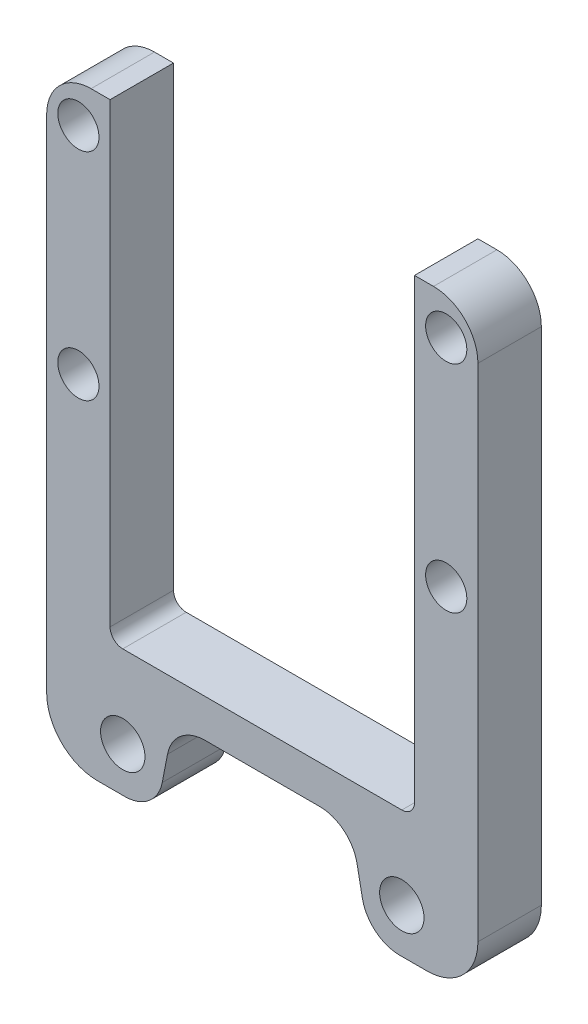
ISO-10303-21;
HEADER;
FILE_DESCRIPTION(('STEP AP214'),'2;1');
FILE_NAME('part.step','',(''),(''),'','','');
FILE_SCHEMA(('AUTOMOTIVE_DESIGN { 1 0 10303 214 1 1 1 1 }'));
ENDSEC;
DATA;
#1=APPLICATION_CONTEXT('core data for automotive mechanical design processes');
#2=APPLICATION_PROTOCOL_DEFINITION('international standard','automotive_design',2000,#1);
#3=PRODUCT_CONTEXT('',#1,'mechanical');
#4=PRODUCT('Part','Part','',(#3));
#5=PRODUCT_RELATED_PRODUCT_CATEGORY('part','',(#4));
#6=PRODUCT_DEFINITION_FORMATION('','',#4);
#7=PRODUCT_DEFINITION_CONTEXT('part definition',#1,'design');
#8=PRODUCT_DEFINITION('design','',#6,#7);
#9=PRODUCT_DEFINITION_SHAPE('','',#8);
#10=(LENGTH_UNIT() NAMED_UNIT(*) SI_UNIT(.MILLI.,.METRE.));
#11=(NAMED_UNIT(*) PLANE_ANGLE_UNIT() SI_UNIT($,.RADIAN.));
#12=(NAMED_UNIT(*) SI_UNIT($,.STERADIAN.) SOLID_ANGLE_UNIT());
#13=UNCERTAINTY_MEASURE_WITH_UNIT(LENGTH_MEASURE(1.E-05),#10,'distance_accuracy_value','');
#14=(GEOMETRIC_REPRESENTATION_CONTEXT(3) GLOBAL_UNCERTAINTY_ASSIGNED_CONTEXT((#13)) GLOBAL_UNIT_ASSIGNED_CONTEXT((#10,
#11,#12)) REPRESENTATION_CONTEXT('',''));
#15=CARTESIAN_POINT('',(0.,0.,0.));
#16=DIRECTION('',(0.,0.,1.));
#17=DIRECTION('',(1.,0.,0.));
#18=AXIS2_PLACEMENT_3D('',#15,#16,#17);
#19=CARTESIAN_POINT('',(0.,0.,10.));
#20=DIRECTION('',(0.,0.,1.));
#21=DIRECTION('',(1.,0.,0.));
#22=AXIS2_PLACEMENT_3D('',#19,#20,#21);
#23=PLANE('',#22);
#24=CARTESIAN_POINT('',(29.,104.,10.));
#25=DIRECTION('',(0.,0.,1.));
#26=DIRECTION('',(1.,0.,0.));
#27=AXIS2_PLACEMENT_3D('',#24,#25,#26);
#28=CIRCLE('',#27,3.25);
#29=CARTESIAN_POINT('',(32.25,104.,10.));
#30=VERTEX_POINT('',#29);
#31=EDGE_CURVE('E260',#30,#30,#28,.T.);
#32=ORIENTED_EDGE('',*,*,#31,.F.);
#33=EDGE_LOOP('',(#32));
#34=FACE_BOUND('',#33,.T.);
#35=DIRECTION('',(0.,1.,0.));
#36=VECTOR('',#35,1.);
#37=CARTESIAN_POINT('',(34.,16.,10.));
#38=LINE('',#37,#36);
#39=CARTESIAN_POINT('',(34.,24.,10.));
#40=VERTEX_POINT('',#39);
#41=CARTESIAN_POINT('',(34.,103.,10.));
#42=VERTEX_POINT('',#41);
#43=EDGE_CURVE('E298',#40,#42,#38,.T.);
#44=ORIENTED_EDGE('',*,*,#43,.T.);
#45=CARTESIAN_POINT('',(27.,103.,10.));
#46=DIRECTION('',(0.,0.,1.));
#47=DIRECTION('',(1.,0.,0.));
#48=AXIS2_PLACEMENT_3D('',#45,#46,#47);
#49=CIRCLE('',#48,7.);
#50=CARTESIAN_POINT('',(27.,110.,10.));
#51=VERTEX_POINT('',#50);
#52=EDGE_CURVE('E423',#42,#51,#49,.T.);
#53=ORIENTED_EDGE('',*,*,#52,.T.);
#54=DIRECTION('',(-1.,0.,0.));
#55=VECTOR('',#54,1.);
#56=CARTESIAN_POINT('',(34.,110.,10.));
#57=LINE('',#56,#55);
#58=CARTESIAN_POINT('',(24.,110.,10.));
#59=VERTEX_POINT('',#58);
#60=EDGE_CURVE('E276',#51,#59,#57,.T.);
#61=ORIENTED_EDGE('',*,*,#60,.T.);
#62=DIRECTION('',(0.,-1.,0.));
#63=VECTOR('',#62,1.);
#64=CARTESIAN_POINT('',(24.,110.,10.));
#65=LINE('',#64,#63);
#66=CARTESIAN_POINT('',(24.,38.,10.));
#67=VERTEX_POINT('',#66);
#68=EDGE_CURVE('E279',#59,#67,#65,.T.);
#69=ORIENTED_EDGE('',*,*,#68,.T.);
#70=CARTESIAN_POINT('',(22.,38.,10.));
#71=DIRECTION('',(0.,0.,1.));
#72=DIRECTION('',(1.,0.,0.));
#73=AXIS2_PLACEMENT_3D('',#70,#71,#72);
#74=CIRCLE('',#73,2.);
#75=CARTESIAN_POINT('',(22.,36.,10.));
#76=VERTEX_POINT('',#75);
#77=EDGE_CURVE('E11',#67,#76,#74,.F.);
#78=ORIENTED_EDGE('',*,*,#77,.T.);
#79=DIRECTION('',(-1.,0.,0.));
#80=VECTOR('',#79,1.);
#81=CARTESIAN_POINT('',(24.,36.,10.));
#82=LINE('',#81,#80);
#83=CARTESIAN_POINT('',(-22.,36.,10.));
#84=VERTEX_POINT('',#83);
#85=EDGE_CURVE('E283',#76,#84,#82,.T.);
#86=ORIENTED_EDGE('',*,*,#85,.T.);
#87=CARTESIAN_POINT('',(-22.,38.,10.));
#88=DIRECTION('',(0.,0.,1.));
#89=DIRECTION('',(1.,0.,0.));
#90=AXIS2_PLACEMENT_3D('',#87,#88,#89);
#91=CIRCLE('',#90,2.);
#92=CARTESIAN_POINT('',(-24.,38.,10.));
#93=VERTEX_POINT('',#92);
#94=EDGE_CURVE('E219',#84,#93,#91,.F.);
#95=ORIENTED_EDGE('',*,*,#94,.T.);
#96=DIRECTION('',(0.,-1.,0.));
#97=VECTOR('',#96,1.);
#98=CARTESIAN_POINT('',(-24.,110.,10.));
#99=LINE('',#98,#97);
#100=CARTESIAN_POINT('',(-24.,110.,10.));
#101=VERTEX_POINT('',#100);
#102=EDGE_CURVE('E201',#101,#93,#99,.T.);
#103=ORIENTED_EDGE('',*,*,#102,.F.);
#104=DIRECTION('',(1.,0.,0.));
#105=VECTOR('',#104,1.);
#106=CARTESIAN_POINT('',(-34.,110.,10.));
#107=LINE('',#106,#105);
#108=CARTESIAN_POINT('',(-27.,110.,10.));
#109=VERTEX_POINT('',#108);
#110=EDGE_CURVE('E189',#109,#101,#107,.T.);
#111=ORIENTED_EDGE('',*,*,#110,.F.);
#112=CARTESIAN_POINT('',(-27.,103.,10.));
#113=DIRECTION('',(0.,0.,1.));
#114=DIRECTION('',(1.,0.,0.));
#115=AXIS2_PLACEMENT_3D('',#112,#113,#114);
#116=CIRCLE('',#115,7.);
#117=CARTESIAN_POINT('',(-34.,103.,10.));
#118=VERTEX_POINT('',#117);
#119=EDGE_CURVE('E420',#109,#118,#116,.T.);
#120=ORIENTED_EDGE('',*,*,#119,.T.);
#121=DIRECTION('',(0.,1.,0.));
#122=VECTOR('',#121,1.);
#123=CARTESIAN_POINT('',(-34.,16.,10.));
#124=LINE('',#123,#122);
#125=CARTESIAN_POINT('',(-34.,24.,10.));
#126=VERTEX_POINT('',#125);
#127=EDGE_CURVE('E213',#126,#118,#124,.T.);
#128=ORIENTED_EDGE('',*,*,#127,.F.);
#129=CARTESIAN_POINT('',(-26.,24.,10.));
#130=DIRECTION('',(0.,0.,1.));
#131=DIRECTION('',(1.,0.,0.));
#132=AXIS2_PLACEMENT_3D('',#129,#130,#131);
#133=CIRCLE('',#132,8.);
#134=CARTESIAN_POINT('',(-26.,16.,10.));
#135=VERTEX_POINT('',#134);
#136=EDGE_CURVE('E397',#126,#135,#133,.T.);
#137=ORIENTED_EDGE('',*,*,#136,.T.);
#138=DIRECTION('',(-1.,0.,0.));
#139=VECTOR('',#138,1.);
#140=CARTESIAN_POINT('',(-16.721324327928,16.,10.));
#141=LINE('',#140,#139);
#142=CARTESIAN_POINT('',(-21.667342642833,16.,10.));
#143=VERTEX_POINT('',#142);
#144=EDGE_CURVE('E225',#143,#135,#141,.T.);
#145=ORIENTED_EDGE('',*,*,#144,.F.);
#146=CARTESIAN_POINT('',(-21.667342642833,22.,10.));
#147=DIRECTION('',(0.,0.,1.));
#148=DIRECTION('',(1.,0.,0.));
#149=AXIS2_PLACEMENT_3D('',#146,#147,#148);
#150=CIRCLE('',#149,6.);
#151=CARTESIAN_POINT('',(-15.777579542147,20.8551460277407,10.));
#152=VERTEX_POINT('',#151);
#153=EDGE_CURVE('E346',#143,#152,#150,.T.);
#154=ORIENTED_EDGE('',*,*,#153,.T.);
#155=DIRECTION('',(-0.190808995376542,-0.981627183447665,0.));
#156=VECTOR('',#155,1.);
#157=CARTESIAN_POINT('',(-14.,30.,10.));
#158=LINE('',#157,#156);
#159=CARTESIAN_POINT('',(-14.943744785781,25.1448539722593,10.));
#160=VERTEX_POINT('',#159);
#161=EDGE_CURVE('E221',#160,#152,#158,.T.);
#162=ORIENTED_EDGE('',*,*,#161,.F.);
#163=CARTESIAN_POINT('',(-9.05398168509501,24.,10.));
#164=DIRECTION('',(0.,0.,1.));
#165=DIRECTION('',(1.,0.,0.));
#166=AXIS2_PLACEMENT_3D('',#163,#164,#165);
#167=CIRCLE('',#166,6.);
#168=CARTESIAN_POINT('',(-9.05398168509501,30.,10.));
#169=VERTEX_POINT('',#168);
#170=EDGE_CURVE('E372',#160,#169,#167,.F.);
#171=ORIENTED_EDGE('',*,*,#170,.T.);
#172=DIRECTION('',(1.,0.,0.));
#173=VECTOR('',#172,1.);
#174=CARTESIAN_POINT('',(0.,30.,10.));
#175=LINE('',#174,#173);
#176=CARTESIAN_POINT('',(9.05398168509501,30.,10.));
#177=VERTEX_POINT('',#176);
#178=EDGE_CURVE('E286',#169,#177,#175,.T.);
#179=ORIENTED_EDGE('',*,*,#178,.T.);
#180=CARTESIAN_POINT('',(9.05398168509501,24.,10.));
#181=DIRECTION('',(0.,0.,1.));
#182=DIRECTION('',(1.,0.,0.));
#183=AXIS2_PLACEMENT_3D('',#180,#181,#182);
#184=CIRCLE('',#183,6.);
#185=CARTESIAN_POINT('',(14.943744785781,25.1448539722593,10.));
#186=VERTEX_POINT('',#185);
#187=EDGE_CURVE('E378',#177,#186,#184,.F.);
#188=ORIENTED_EDGE('',*,*,#187,.T.);
#189=DIRECTION('',(0.190808995376542,-0.981627183447665,0.));
#190=VECTOR('',#189,1.);
#191=CARTESIAN_POINT('',(14.,30.,10.));
#192=LINE('',#191,#190);
#193=CARTESIAN_POINT('',(15.777579542147,20.8551460277407,10.));
#194=VERTEX_POINT('',#193);
#195=EDGE_CURVE('E290',#186,#194,#192,.T.);
#196=ORIENTED_EDGE('',*,*,#195,.T.);
#197=CARTESIAN_POINT('',(21.667342642833,22.,10.));
#198=DIRECTION('',(0.,0.,1.));
#199=DIRECTION('',(1.,0.,0.));
#200=AXIS2_PLACEMENT_3D('',#197,#198,#199);
#201=CIRCLE('',#200,6.);
#202=CARTESIAN_POINT('',(21.667342642833,16.,10.));
#203=VERTEX_POINT('',#202);
#204=EDGE_CURVE('E349',#194,#203,#201,.T.);
#205=ORIENTED_EDGE('',*,*,#204,.T.);
#206=DIRECTION('',(1.,0.,0.));
#207=VECTOR('',#206,1.);
#208=CARTESIAN_POINT('',(16.721324327928,16.,10.));
#209=LINE('',#208,#207);
#210=CARTESIAN_POINT('',(26.,16.,10.));
#211=VERTEX_POINT('',#210);
#212=EDGE_CURVE('E294',#203,#211,#209,.T.);
#213=ORIENTED_EDGE('',*,*,#212,.T.);
#214=CARTESIAN_POINT('',(26.,24.,10.));
#215=DIRECTION('',(0.,0.,1.));
#216=DIRECTION('',(1.,0.,0.));
#217=AXIS2_PLACEMENT_3D('',#214,#215,#216);
#218=CIRCLE('',#217,8.);
#219=EDGE_CURVE('E394',#211,#40,#218,.T.);
#220=ORIENTED_EDGE('',*,*,#219,.T.);
#221=EDGE_LOOP('',(#44,#53,#61,#69,#78,#86,#95,#103,#111,#120,#128,#137,#145,#154,#162,#171,
#179,#188,#196,#205,#213,#220));
#222=FACE_BOUND('',#221,.T.);
#223=CARTESIAN_POINT('',(22.,23.,10.));
#224=DIRECTION('',(0.,0.,1.));
#225=DIRECTION('',(1.,0.,0.));
#226=AXIS2_PLACEMENT_3D('',#223,#224,#225);
#227=CIRCLE('',#226,3.5);
#228=CARTESIAN_POINT('',(25.5,23.,10.));
#229=VERTEX_POINT('',#228);
#230=EDGE_CURVE('E268',#229,#229,#227,.T.);
#231=ORIENTED_EDGE('',*,*,#230,.F.);
#232=EDGE_LOOP('',(#231));
#233=FACE_BOUND('',#232,.T.);
#234=CARTESIAN_POINT('',(29.,70.,10.));
#235=DIRECTION('',(0.,0.,1.));
#236=DIRECTION('',(1.,0.,0.));
#237=AXIS2_PLACEMENT_3D('',#234,#235,#236);
#238=CIRCLE('',#237,3.25);
#239=CARTESIAN_POINT('',(32.25,70.,10.));
#240=VERTEX_POINT('',#239);
#241=EDGE_CURVE('E252',#240,#240,#238,.T.);
#242=ORIENTED_EDGE('',*,*,#241,.F.);
#243=EDGE_LOOP('',(#242));
#244=FACE_BOUND('',#243,.T.);
#245=CARTESIAN_POINT('',(-29.,104.,10.));
#246=DIRECTION('',(0.,0.,-1.));
#247=DIRECTION('',(-1.,0.,0.));
#248=AXIS2_PLACEMENT_3D('',#245,#246,#247);
#249=CIRCLE('',#248,3.25);
#250=CARTESIAN_POINT('',(-32.25,104.,10.));
#251=VERTEX_POINT('',#250);
#252=EDGE_CURVE('E634',#251,#251,#249,.T.);
#253=ORIENTED_EDGE('',*,*,#252,.T.);
#254=EDGE_LOOP('',(#253));
#255=FACE_BOUND('',#254,.T.);
#256=CARTESIAN_POINT('',(-22.,23.,10.));
#257=DIRECTION('',(0.,0.,-1.));
#258=DIRECTION('',(-1.,0.,0.));
#259=AXIS2_PLACEMENT_3D('',#256,#257,#258);
#260=CIRCLE('',#259,3.5);
#261=CARTESIAN_POINT('',(-25.5,23.,10.));
#262=VERTEX_POINT('',#261);
#263=EDGE_CURVE('E238',#262,#262,#260,.T.);
#264=ORIENTED_EDGE('',*,*,#263,.T.);
#265=EDGE_LOOP('',(#264));
#266=FACE_BOUND('',#265,.T.);
#267=CARTESIAN_POINT('',(-29.,70.,10.));
#268=DIRECTION('',(0.,0.,-1.));
#269=DIRECTION('',(-1.,0.,0.));
#270=AXIS2_PLACEMENT_3D('',#267,#268,#269);
#271=CIRCLE('',#270,3.25);
#272=CARTESIAN_POINT('',(-32.25,70.,10.));
#273=VERTEX_POINT('',#272);
#274=EDGE_CURVE('E628',#273,#273,#271,.T.);
#275=ORIENTED_EDGE('',*,*,#274,.T.);
#276=EDGE_LOOP('',(#275));
#277=FACE_BOUND('',#276,.T.);
#278=ADVANCED_FACE('F39',(#34,#222,#233,#244,#255,#266,#277),#23,.T.);
#279=CARTESIAN_POINT('',(0.,0.,0.));
#280=DIRECTION('',(0.,0.,1.));
#281=DIRECTION('',(1.,0.,0.));
#282=AXIS2_PLACEMENT_3D('',#279,#280,#281);
#283=PLANE('',#282);
#284=DIRECTION('',(-1.,0.,0.));
#285=VECTOR('',#284,1.);
#286=CARTESIAN_POINT('',(34.,110.,0.));
#287=LINE('',#286,#285);
#288=CARTESIAN_POINT('',(27.,110.,0.));
#289=VERTEX_POINT('',#288);
#290=CARTESIAN_POINT('',(24.,110.,0.));
#291=VERTEX_POINT('',#290);
#292=EDGE_CURVE('E272',#289,#291,#287,.T.);
#293=ORIENTED_EDGE('',*,*,#292,.F.);
#294=CARTESIAN_POINT('',(27.,103.,0.));
#295=DIRECTION('',(0.,0.,1.));
#296=DIRECTION('',(1.,0.,0.));
#297=AXIS2_PLACEMENT_3D('',#294,#295,#296);
#298=CIRCLE('',#297,7.);
#299=CARTESIAN_POINT('',(34.,103.,0.));
#300=VERTEX_POINT('',#299);
#301=EDGE_CURVE('E414',#289,#300,#298,.F.);
#302=ORIENTED_EDGE('',*,*,#301,.T.);
#303=DIRECTION('',(0.,1.,0.));
#304=VECTOR('',#303,1.);
#305=CARTESIAN_POINT('',(34.,16.,0.));
#306=LINE('',#305,#304);
#307=CARTESIAN_POINT('',(34.,24.,0.));
#308=VERTEX_POINT('',#307);
#309=EDGE_CURVE('E280',#308,#300,#306,.T.);
#310=ORIENTED_EDGE('',*,*,#309,.F.);
#311=CARTESIAN_POINT('',(26.,24.,0.));
#312=DIRECTION('',(0.,0.,1.));
#313=DIRECTION('',(1.,0.,0.));
#314=AXIS2_PLACEMENT_3D('',#311,#312,#313);
#315=CIRCLE('',#314,8.);
#316=CARTESIAN_POINT('',(26.,16.,0.));
#317=VERTEX_POINT('',#316);
#318=EDGE_CURVE('E385',#308,#317,#315,.F.);
#319=ORIENTED_EDGE('',*,*,#318,.T.);
#320=DIRECTION('',(1.,0.,0.));
#321=VECTOR('',#320,1.);
#322=CARTESIAN_POINT('',(16.721324327928,16.,0.));
#323=LINE('',#322,#321);
#324=CARTESIAN_POINT('',(21.667342642833,16.,0.));
#325=VERTEX_POINT('',#324);
#326=EDGE_CURVE('E319',#325,#317,#323,.T.);
#327=ORIENTED_EDGE('',*,*,#326,.F.);
#328=CARTESIAN_POINT('',(21.667342642833,22.,0.));
#329=DIRECTION('',(0.,0.,1.));
#330=DIRECTION('',(1.,0.,0.));
#331=AXIS2_PLACEMENT_3D('',#328,#329,#330);
#332=CIRCLE('',#331,6.);
#333=CARTESIAN_POINT('',(15.777579542147,20.8551460277407,0.));
#334=VERTEX_POINT('',#333);
#335=EDGE_CURVE('E336',#325,#334,#332,.F.);
#336=ORIENTED_EDGE('',*,*,#335,.T.);
#337=DIRECTION('',(0.190808995376542,-0.981627183447665,0.));
#338=VECTOR('',#337,1.);
#339=CARTESIAN_POINT('',(14.,30.,0.));
#340=LINE('',#339,#338);
#341=CARTESIAN_POINT('',(14.943744785781,25.1448539722593,0.));
#342=VERTEX_POINT('',#341);
#343=EDGE_CURVE('E315',#342,#334,#340,.T.);
#344=ORIENTED_EDGE('',*,*,#343,.F.);
#345=CARTESIAN_POINT('',(9.05398168509501,24.,0.));
#346=DIRECTION('',(0.,0.,1.));
#347=DIRECTION('',(1.,0.,0.));
#348=AXIS2_PLACEMENT_3D('',#345,#346,#347);
#349=CIRCLE('',#348,6.);
#350=CARTESIAN_POINT('',(9.05398168509501,30.,0.));
#351=VERTEX_POINT('',#350);
#352=EDGE_CURVE('E375',#342,#351,#349,.T.);
#353=ORIENTED_EDGE('',*,*,#352,.T.);
#354=DIRECTION('',(1.,0.,0.));
#355=VECTOR('',#354,1.);
#356=CARTESIAN_POINT('',(0.,30.,0.));
#357=LINE('',#356,#355);
#358=CARTESIAN_POINT('',(-9.05398168509501,30.,0.));
#359=VERTEX_POINT('',#358);
#360=EDGE_CURVE('E311',#359,#351,#357,.T.);
#361=ORIENTED_EDGE('',*,*,#360,.F.);
#362=CARTESIAN_POINT('',(-9.05398168509501,24.,0.));
#363=DIRECTION('',(0.,0.,1.));
#364=DIRECTION('',(1.,0.,0.));
#365=AXIS2_PLACEMENT_3D('',#362,#363,#364);
#366=CIRCLE('',#365,6.);
#367=CARTESIAN_POINT('',(-14.943744785781,25.1448539722593,0.));
#368=VERTEX_POINT('',#367);
#369=EDGE_CURVE('E369',#359,#368,#366,.T.);
#370=ORIENTED_EDGE('',*,*,#369,.T.);
#371=DIRECTION('',(-0.190808995376542,-0.981627183447665,0.));
#372=VECTOR('',#371,1.);
#373=CARTESIAN_POINT('',(-14.,30.,0.));
#374=LINE('',#373,#372);
#375=CARTESIAN_POINT('',(-15.777579542147,20.8551460277407,0.));
#376=VERTEX_POINT('',#375);
#377=EDGE_CURVE('E241',#368,#376,#374,.T.);
#378=ORIENTED_EDGE('',*,*,#377,.T.);
#379=CARTESIAN_POINT('',(-21.667342642833,22.,0.));
#380=DIRECTION('',(0.,0.,1.));
#381=DIRECTION('',(1.,0.,0.));
#382=AXIS2_PLACEMENT_3D('',#379,#380,#381);
#383=CIRCLE('',#382,6.);
#384=CARTESIAN_POINT('',(-21.667342642833,16.,0.));
#385=VERTEX_POINT('',#384);
#386=EDGE_CURVE('E333',#376,#385,#383,.F.);
#387=ORIENTED_EDGE('',*,*,#386,.T.);
#388=DIRECTION('',(-1.,0.,0.));
#389=VECTOR('',#388,1.);
#390=CARTESIAN_POINT('',(-16.721324327928,16.,0.));
#391=LINE('',#390,#389);
#392=CARTESIAN_POINT('',(-26.,16.,0.));
#393=VERTEX_POINT('',#392);
#394=EDGE_CURVE('E245',#385,#393,#391,.T.);
#395=ORIENTED_EDGE('',*,*,#394,.T.);
#396=CARTESIAN_POINT('',(-26.,24.,0.));
#397=DIRECTION('',(0.,0.,1.));
#398=DIRECTION('',(1.,0.,0.));
#399=AXIS2_PLACEMENT_3D('',#396,#397,#398);
#400=CIRCLE('',#399,8.);
#401=CARTESIAN_POINT('',(-34.,24.,0.));
#402=VERTEX_POINT('',#401);
#403=EDGE_CURVE('E388',#393,#402,#400,.F.);
#404=ORIENTED_EDGE('',*,*,#403,.T.);
#405=DIRECTION('',(0.,1.,0.));
#406=VECTOR('',#405,1.);
#407=CARTESIAN_POINT('',(-34.,16.,0.));
#408=LINE('',#407,#406);
#409=CARTESIAN_POINT('',(-34.,103.,0.));
#410=VERTEX_POINT('',#409);
#411=EDGE_CURVE('E202',#402,#410,#408,.T.);
#412=ORIENTED_EDGE('',*,*,#411,.T.);
#413=CARTESIAN_POINT('',(-27.,103.,0.));
#414=DIRECTION('',(0.,0.,1.));
#415=DIRECTION('',(1.,0.,0.));
#416=AXIS2_PLACEMENT_3D('',#413,#414,#415);
#417=CIRCLE('',#416,7.);
#418=CARTESIAN_POINT('',(-27.,110.,0.));
#419=VERTEX_POINT('',#418);
#420=EDGE_CURVE('E411',#410,#419,#417,.F.);
#421=ORIENTED_EDGE('',*,*,#420,.T.);
#422=DIRECTION('',(1.,0.,0.));
#423=VECTOR('',#422,1.);
#424=CARTESIAN_POINT('',(-34.,110.,0.));
#425=LINE('',#424,#423);
#426=CARTESIAN_POINT('',(-24.,110.,0.));
#427=VERTEX_POINT('',#426);
#428=EDGE_CURVE('E235',#419,#427,#425,.T.);
#429=ORIENTED_EDGE('',*,*,#428,.T.);
#430=DIRECTION('',(0.,-1.,0.));
#431=VECTOR('',#430,1.);
#432=CARTESIAN_POINT('',(-24.,110.,0.));
#433=LINE('',#432,#431);
#434=CARTESIAN_POINT('',(-24.,38.,0.));
#435=VERTEX_POINT('',#434);
#436=EDGE_CURVE('E210',#427,#435,#433,.T.);
#437=ORIENTED_EDGE('',*,*,#436,.T.);
#438=CARTESIAN_POINT('',(-22.,38.,0.));
#439=DIRECTION('',(0.,0.,1.));
#440=DIRECTION('',(1.,0.,0.));
#441=AXIS2_PLACEMENT_3D('',#438,#439,#440);
#442=CIRCLE('',#441,2.);
#443=CARTESIAN_POINT('',(-22.,36.,0.));
#444=VERTEX_POINT('',#443);
#445=EDGE_CURVE('E444',#435,#444,#442,.T.);
#446=ORIENTED_EDGE('',*,*,#445,.T.);
#447=DIRECTION('',(-1.,0.,0.));
#448=VECTOR('',#447,1.);
#449=CARTESIAN_POINT('',(24.,36.,0.));
#450=LINE('',#449,#448);
#451=CARTESIAN_POINT('',(22.,36.,0.));
#452=VERTEX_POINT('',#451);
#453=EDGE_CURVE('E307',#452,#444,#450,.T.);
#454=ORIENTED_EDGE('',*,*,#453,.F.);
#455=CARTESIAN_POINT('',(22.,38.,0.));
#456=DIRECTION('',(0.,0.,1.));
#457=DIRECTION('',(1.,0.,0.));
#458=AXIS2_PLACEMENT_3D('',#455,#456,#457);
#459=CIRCLE('',#458,2.);
#460=CARTESIAN_POINT('',(24.,38.,0.));
#461=VERTEX_POINT('',#460);
#462=EDGE_CURVE('E48',#452,#461,#459,.T.);
#463=ORIENTED_EDGE('',*,*,#462,.T.);
#464=DIRECTION('',(0.,-1.,0.));
#465=VECTOR('',#464,1.);
#466=CARTESIAN_POINT('',(24.,110.,0.));
#467=LINE('',#466,#465);
#468=EDGE_CURVE('E304',#291,#461,#467,.T.);
#469=ORIENTED_EDGE('',*,*,#468,.F.);
#470=EDGE_LOOP('',(#293,#302,#310,#319,#327,#336,#344,#353,#361,#370,#378,#387,#395,#404,#412,
#421,#429,#437,#446,#454,#463,#469));
#471=FACE_BOUND('',#470,.T.);
#472=CARTESIAN_POINT('',(22.,23.,0.));
#473=DIRECTION('',(0.,0.,1.));
#474=DIRECTION('',(1.,0.,0.));
#475=AXIS2_PLACEMENT_3D('',#472,#473,#474);
#476=CIRCLE('',#475,3.5);
#477=CARTESIAN_POINT('',(25.5,23.,0.));
#478=VERTEX_POINT('',#477);
#479=EDGE_CURVE('E264',#478,#478,#476,.T.);
#480=ORIENTED_EDGE('',*,*,#479,.T.);
#481=EDGE_LOOP('',(#480));
#482=FACE_BOUND('',#481,.T.);
#483=CARTESIAN_POINT('',(29.,104.,0.));
#484=DIRECTION('',(0.,0.,1.));
#485=DIRECTION('',(1.,0.,0.));
#486=AXIS2_PLACEMENT_3D('',#483,#484,#485);
#487=CIRCLE('',#486,3.25);
#488=CARTESIAN_POINT('',(32.25,104.,0.));
#489=VERTEX_POINT('',#488);
#490=EDGE_CURVE('E256',#489,#489,#487,.T.);
#491=ORIENTED_EDGE('',*,*,#490,.T.);
#492=EDGE_LOOP('',(#491));
#493=FACE_BOUND('',#492,.T.);
#494=CARTESIAN_POINT('',(29.,70.,0.));
#495=DIRECTION('',(0.,0.,1.));
#496=DIRECTION('',(1.,0.,0.));
#497=AXIS2_PLACEMENT_3D('',#494,#495,#496);
#498=CIRCLE('',#497,3.25);
#499=CARTESIAN_POINT('',(32.25,70.,0.));
#500=VERTEX_POINT('',#499);
#501=EDGE_CURVE('E212',#500,#500,#498,.T.);
#502=ORIENTED_EDGE('',*,*,#501,.T.);
#503=EDGE_LOOP('',(#502));
#504=FACE_BOUND('',#503,.T.);
#505=CARTESIAN_POINT('',(-22.,23.,0.));
#506=DIRECTION('',(0.,0.,-1.));
#507=DIRECTION('',(-1.,0.,0.));
#508=AXIS2_PLACEMENT_3D('',#505,#506,#507);
#509=CIRCLE('',#508,3.5);
#510=CARTESIAN_POINT('',(-25.5,23.,0.));
#511=VERTEX_POINT('',#510);
#512=EDGE_CURVE('E618',#511,#511,#509,.T.);
#513=ORIENTED_EDGE('',*,*,#512,.F.);
#514=EDGE_LOOP('',(#513));
#515=FACE_BOUND('',#514,.T.);
#516=CARTESIAN_POINT('',(-29.,104.,0.));
#517=DIRECTION('',(0.,0.,-1.));
#518=DIRECTION('',(-1.,0.,0.));
#519=AXIS2_PLACEMENT_3D('',#516,#517,#518);
#520=CIRCLE('',#519,3.25);
#521=CARTESIAN_POINT('',(-32.25,104.,0.));
#522=VERTEX_POINT('',#521);
#523=EDGE_CURVE('E622',#522,#522,#520,.T.);
#524=ORIENTED_EDGE('',*,*,#523,.F.);
#525=EDGE_LOOP('',(#524));
#526=FACE_BOUND('',#525,.T.);
#527=CARTESIAN_POINT('',(-29.,70.,0.));
#528=DIRECTION('',(0.,0.,-1.));
#529=DIRECTION('',(-1.,0.,0.));
#530=AXIS2_PLACEMENT_3D('',#527,#528,#529);
#531=CIRCLE('',#530,3.25);
#532=CARTESIAN_POINT('',(-32.25,70.,0.));
#533=VERTEX_POINT('',#532);
#534=EDGE_CURVE('E625',#533,#533,#531,.T.);
#535=ORIENTED_EDGE('',*,*,#534,.F.);
#536=EDGE_LOOP('',(#535));
#537=FACE_BOUND('',#536,.T.);
#538=ADVANCED_FACE('F450',(#471,#482,#493,#504,#515,#526,#537),#283,.F.);
#539=CARTESIAN_POINT('',(34.,110.,10.));
#540=DIRECTION('',(0.,-1.,0.));
#541=DIRECTION('',(0.,0.,-1.));
#542=AXIS2_PLACEMENT_3D('',#539,#540,#541);
#543=PLANE('',#542);
#544=ORIENTED_EDGE('',*,*,#60,.F.);
#545=DIRECTION('',(0.,0.,-1.));
#546=VECTOR('',#545,1.);
#547=CARTESIAN_POINT('',(27.,110.,10.));
#548=LINE('',#547,#546);
#549=EDGE_CURVE('E407',#51,#289,#548,.T.);
#550=ORIENTED_EDGE('',*,*,#549,.T.);
#551=ORIENTED_EDGE('',*,*,#292,.T.);
#552=DIRECTION('',(0.,0.,-1.));
#553=VECTOR('',#552,1.);
#554=CARTESIAN_POINT('',(24.,110.,10.));
#555=LINE('',#554,#553);
#556=EDGE_CURVE('E301',#59,#291,#555,.T.);
#557=ORIENTED_EDGE('',*,*,#556,.F.);
#558=EDGE_LOOP('',(#544,#550,#551,#557));
#559=FACE_BOUND('',#558,.T.);
#560=ADVANCED_FACE('F475',(#559),#543,.F.);
#561=CARTESIAN_POINT('',(24.,110.,10.));
#562=DIRECTION('',(1.,0.,0.));
#563=DIRECTION('',(0.,1.,0.));
#564=AXIS2_PLACEMENT_3D('',#561,#562,#563);
#565=PLANE('',#564);
#566=ORIENTED_EDGE('',*,*,#468,.T.);
#567=DIRECTION('',(0.,0.,-1.));
#568=VECTOR('',#567,1.);
#569=CARTESIAN_POINT('',(24.,38.,10.));
#570=LINE('',#569,#568);
#571=EDGE_CURVE('E55',#461,#67,#570,.F.);
#572=ORIENTED_EDGE('',*,*,#571,.T.);
#573=ORIENTED_EDGE('',*,*,#68,.F.);
#574=ORIENTED_EDGE('',*,*,#556,.T.);
#575=EDGE_LOOP('',(#566,#572,#573,#574));
#576=FACE_BOUND('',#575,.T.);
#577=ADVANCED_FACE('F500',(#576),#565,.F.);
#578=CARTESIAN_POINT('',(24.,36.,10.));
#579=DIRECTION('',(0.,-1.,0.));
#580=DIRECTION('',(0.,0.,-1.));
#581=AXIS2_PLACEMENT_3D('',#578,#579,#580);
#582=PLANE('',#581);
#583=ORIENTED_EDGE('',*,*,#453,.T.);
#584=DIRECTION('',(0.,0.,-1.));
#585=VECTOR('',#584,1.);
#586=CARTESIAN_POINT('',(-22.,36.,10.));
#587=LINE('',#586,#585);
#588=EDGE_CURVE('E439',#444,#84,#587,.F.);
#589=ORIENTED_EDGE('',*,*,#588,.T.);
#590=ORIENTED_EDGE('',*,*,#85,.F.);
#591=DIRECTION('',(0.,0.,-1.));
#592=VECTOR('',#591,1.);
#593=CARTESIAN_POINT('',(22.,36.,0.));
#594=LINE('',#593,#592);
#595=EDGE_CURVE('E435',#76,#452,#594,.T.);
#596=ORIENTED_EDGE('',*,*,#595,.T.);
#597=EDGE_LOOP('',(#583,#589,#590,#596));
#598=FACE_BOUND('',#597,.T.);
#599=ADVANCED_FACE('F455',(#598),#582,.F.);
#600=CARTESIAN_POINT('',(0.,30.,10.));
#601=DIRECTION('',(0.,1.,0.));
#602=DIRECTION('',(0.,0.,1.));
#603=AXIS2_PLACEMENT_3D('',#600,#601,#602);
#604=PLANE('',#603);
#605=ORIENTED_EDGE('',*,*,#178,.F.);
#606=DIRECTION('',(0.,0.,-1.));
#607=VECTOR('',#606,1.);
#608=CARTESIAN_POINT('',(-9.05398168509501,30.,0.));
#609=LINE('',#608,#607);
#610=EDGE_CURVE('E365',#169,#359,#609,.T.);
#611=ORIENTED_EDGE('',*,*,#610,.T.);
#612=ORIENTED_EDGE('',*,*,#360,.T.);
#613=DIRECTION('',(0.,0.,-1.));
#614=VECTOR('',#613,1.);
#615=CARTESIAN_POINT('',(9.05398168509501,30.,10.));
#616=LINE('',#615,#614);
#617=EDGE_CURVE('E362',#351,#177,#616,.F.);
#618=ORIENTED_EDGE('',*,*,#617,.T.);
#619=EDGE_LOOP('',(#605,#611,#612,#618));
#620=FACE_BOUND('',#619,.T.);
#621=ADVANCED_FACE('F493',(#620),#604,.F.);
#622=CARTESIAN_POINT('',(14.,30.,10.));
#623=DIRECTION('',(0.981627183447665,0.190808995376542,0.));
#624=DIRECTION('',(-0.190808995376542,0.981627183447665,0.));
#625=AXIS2_PLACEMENT_3D('',#622,#623,#624);
#626=PLANE('',#625);
#627=ORIENTED_EDGE('',*,*,#343,.T.);
#628=DIRECTION('',(0.,0.,-1.));
#629=VECTOR('',#628,1.);
#630=CARTESIAN_POINT('',(15.777579542147,20.8551460277407,10.));
#631=LINE('',#630,#629);
#632=EDGE_CURVE('E343',#334,#194,#631,.F.);
#633=ORIENTED_EDGE('',*,*,#632,.T.);
#634=ORIENTED_EDGE('',*,*,#195,.F.);
#635=DIRECTION('',(0.,0.,-1.));
#636=VECTOR('',#635,1.);
#637=CARTESIAN_POINT('',(14.943744785781,25.1448539722593,0.));
#638=LINE('',#637,#636);
#639=EDGE_CURVE('E339',#186,#342,#638,.T.);
#640=ORIENTED_EDGE('',*,*,#639,.T.);
#641=EDGE_LOOP('',(#627,#633,#634,#640));
#642=FACE_BOUND('',#641,.T.);
#643=ADVANCED_FACE('F489',(#642),#626,.F.);
#644=CARTESIAN_POINT('',(16.721324327928,16.,10.));
#645=DIRECTION('',(0.,1.,0.));
#646=DIRECTION('',(0.,0.,1.));
#647=AXIS2_PLACEMENT_3D('',#644,#645,#646);
#648=PLANE('',#647);
#649=ORIENTED_EDGE('',*,*,#326,.T.);
#650=DIRECTION('',(0.,0.,-1.));
#651=VECTOR('',#650,1.);
#652=CARTESIAN_POINT('',(26.,16.,10.));
#653=LINE('',#652,#651);
#654=EDGE_CURVE('E404',#317,#211,#653,.F.);
#655=ORIENTED_EDGE('',*,*,#654,.T.);
#656=ORIENTED_EDGE('',*,*,#212,.F.);
#657=DIRECTION('',(0.,0.,-1.));
#658=VECTOR('',#657,1.);
#659=CARTESIAN_POINT('',(21.667342642833,16.,10.));
#660=LINE('',#659,#658);
#661=EDGE_CURVE('E329',#203,#325,#660,.T.);
#662=ORIENTED_EDGE('',*,*,#661,.T.);
#663=EDGE_LOOP('',(#649,#655,#656,#662));
#664=FACE_BOUND('',#663,.T.);
#665=ADVANCED_FACE('F485',(#664),#648,.F.);
#666=CARTESIAN_POINT('',(34.,16.,10.));
#667=DIRECTION('',(-1.,0.,0.));
#668=DIRECTION('',(0.,0.,1.));
#669=AXIS2_PLACEMENT_3D('',#666,#667,#668);
#670=PLANE('',#669);
#671=ORIENTED_EDGE('',*,*,#309,.T.);
#672=DIRECTION('',(0.,0.,-1.));
#673=VECTOR('',#672,1.);
#674=CARTESIAN_POINT('',(34.,103.,10.));
#675=LINE('',#674,#673);
#676=EDGE_CURVE('E417',#300,#42,#675,.F.);
#677=ORIENTED_EDGE('',*,*,#676,.T.);
#678=ORIENTED_EDGE('',*,*,#43,.F.);
#679=DIRECTION('',(0.,0.,-1.));
#680=VECTOR('',#679,1.);
#681=CARTESIAN_POINT('',(34.,24.,10.));
#682=LINE('',#681,#680);
#683=EDGE_CURVE('E400',#40,#308,#682,.T.);
#684=ORIENTED_EDGE('',*,*,#683,.T.);
#685=EDGE_LOOP('',(#671,#677,#678,#684));
#686=FACE_BOUND('',#685,.T.);
#687=ADVANCED_FACE('F482',(#686),#670,.F.);
#688=CARTESIAN_POINT('',(22.,23.,10.));
#689=DIRECTION('',(0.,0.,-1.));
#690=DIRECTION('',(-1.,0.,0.));
#691=AXIS2_PLACEMENT_3D('',#688,#689,#690);
#692=CYLINDRICAL_SURFACE('',#691,3.5);
#693=ORIENTED_EDGE('',*,*,#230,.T.);
#694=EDGE_LOOP('',(#693));
#695=FACE_BOUND('',#694,.T.);
#696=ORIENTED_EDGE('',*,*,#479,.F.);
#697=EDGE_LOOP('',(#696));
#698=FACE_BOUND('',#697,.T.);
#699=ADVANCED_FACE('F479',(#695,#698),#692,.F.);
#700=CARTESIAN_POINT('',(29.,104.,10.));
#701=DIRECTION('',(0.,0.,-1.));
#702=DIRECTION('',(-1.,0.,0.));
#703=AXIS2_PLACEMENT_3D('',#700,#701,#702);
#704=CYLINDRICAL_SURFACE('',#703,3.25);
#705=ORIENTED_EDGE('',*,*,#31,.T.);
#706=EDGE_LOOP('',(#705));
#707=FACE_BOUND('',#706,.T.);
#708=ORIENTED_EDGE('',*,*,#490,.F.);
#709=EDGE_LOOP('',(#708));
#710=FACE_BOUND('',#709,.T.);
#711=ADVANCED_FACE('F601',(#707,#710),#704,.F.);
#712=CARTESIAN_POINT('',(29.,70.,10.));
#713=DIRECTION('',(0.,0.,-1.));
#714=DIRECTION('',(-1.,0.,0.));
#715=AXIS2_PLACEMENT_3D('',#712,#713,#714);
#716=CYLINDRICAL_SURFACE('',#715,3.25);
#717=ORIENTED_EDGE('',*,*,#241,.T.);
#718=EDGE_LOOP('',(#717));
#719=FACE_BOUND('',#718,.T.);
#720=ORIENTED_EDGE('',*,*,#501,.F.);
#721=EDGE_LOOP('',(#720));
#722=FACE_BOUND('',#721,.T.);
#723=ADVANCED_FACE('F599',(#719,#722),#716,.F.);
#724=CARTESIAN_POINT('',(-34.,110.,10.));
#725=DIRECTION('',(0.,-1.,0.));
#726=DIRECTION('',(0.,0.,-1.));
#727=AXIS2_PLACEMENT_3D('',#724,#725,#726);
#728=PLANE('',#727);
#729=ORIENTED_EDGE('',*,*,#428,.F.);
#730=DIRECTION('',(0.,0.,-1.));
#731=VECTOR('',#730,1.);
#732=CARTESIAN_POINT('',(-27.,110.,10.));
#733=LINE('',#732,#731);
#734=EDGE_CURVE('E196',#419,#109,#733,.F.);
#735=ORIENTED_EDGE('',*,*,#734,.T.);
#736=ORIENTED_EDGE('',*,*,#110,.T.);
#737=DIRECTION('',(0.,0.,-1.));
#738=VECTOR('',#737,1.);
#739=CARTESIAN_POINT('',(-24.,110.,10.));
#740=LINE('',#739,#738);
#741=EDGE_CURVE('E193',#101,#427,#740,.T.);
#742=ORIENTED_EDGE('',*,*,#741,.T.);
#743=EDGE_LOOP('',(#729,#735,#736,#742));
#744=FACE_BOUND('',#743,.T.);
#745=ADVANCED_FACE('F192',(#744),#728,.F.);
#746=CARTESIAN_POINT('',(-24.,110.,10.));
#747=DIRECTION('',(-1.,0.,0.));
#748=DIRECTION('',(0.,1.,0.));
#749=AXIS2_PLACEMENT_3D('',#746,#747,#748);
#750=PLANE('',#749);
#751=ORIENTED_EDGE('',*,*,#102,.T.);
#752=DIRECTION('',(0.,0.,-1.));
#753=VECTOR('',#752,1.);
#754=CARTESIAN_POINT('',(-24.,38.,0.));
#755=LINE('',#754,#753);
#756=EDGE_CURVE('E432',#93,#435,#755,.T.);
#757=ORIENTED_EDGE('',*,*,#756,.T.);
#758=ORIENTED_EDGE('',*,*,#436,.F.);
#759=ORIENTED_EDGE('',*,*,#741,.F.);
#760=EDGE_LOOP('',(#751,#757,#758,#759));
#761=FACE_BOUND('',#760,.T.);
#762=ADVANCED_FACE('F206',(#761),#750,.F.);
#763=CARTESIAN_POINT('',(-14.,30.,10.));
#764=DIRECTION('',(-0.981627183447665,0.190808995376542,0.));
#765=DIRECTION('',(0.190808995376542,0.981627183447665,0.));
#766=AXIS2_PLACEMENT_3D('',#763,#764,#765);
#767=PLANE('',#766);
#768=ORIENTED_EDGE('',*,*,#161,.T.);
#769=DIRECTION('',(0.,0.,-1.));
#770=VECTOR('',#769,1.);
#771=CARTESIAN_POINT('',(-15.777579542147,20.8551460277407,10.));
#772=LINE('',#771,#770);
#773=EDGE_CURVE('E355',#152,#376,#772,.T.);
#774=ORIENTED_EDGE('',*,*,#773,.T.);
#775=ORIENTED_EDGE('',*,*,#377,.F.);
#776=DIRECTION('',(0.,0.,-1.));
#777=VECTOR('',#776,1.);
#778=CARTESIAN_POINT('',(-14.943744785781,25.1448539722593,10.));
#779=LINE('',#778,#777);
#780=EDGE_CURVE('E352',#368,#160,#779,.F.);
#781=ORIENTED_EDGE('',*,*,#780,.T.);
#782=EDGE_LOOP('',(#768,#774,#775,#781));
#783=FACE_BOUND('',#782,.T.);
#784=ADVANCED_FACE('F563',(#783),#767,.F.);
#785=CARTESIAN_POINT('',(-16.721324327928,16.,10.));
#786=DIRECTION('',(0.,1.,0.));
#787=DIRECTION('',(0.,0.,1.));
#788=AXIS2_PLACEMENT_3D('',#785,#786,#787);
#789=PLANE('',#788);
#790=ORIENTED_EDGE('',*,*,#144,.T.);
#791=DIRECTION('',(0.,0.,-1.));
#792=VECTOR('',#791,1.);
#793=CARTESIAN_POINT('',(-26.,16.,10.));
#794=LINE('',#793,#792);
#795=EDGE_CURVE('E381',#135,#393,#794,.T.);
#796=ORIENTED_EDGE('',*,*,#795,.T.);
#797=ORIENTED_EDGE('',*,*,#394,.F.);
#798=DIRECTION('',(0.,0.,-1.));
#799=VECTOR('',#798,1.);
#800=CARTESIAN_POINT('',(-21.667342642833,16.,10.));
#801=LINE('',#800,#799);
#802=EDGE_CURVE('E359',#385,#143,#801,.F.);
#803=ORIENTED_EDGE('',*,*,#802,.T.);
#804=EDGE_LOOP('',(#790,#796,#797,#803));
#805=FACE_BOUND('',#804,.T.);
#806=ADVANCED_FACE('F570',(#805),#789,.F.);
#807=CARTESIAN_POINT('',(-34.,16.,10.));
#808=DIRECTION('',(1.,0.,0.));
#809=DIRECTION('',(0.,0.,1.));
#810=AXIS2_PLACEMENT_3D('',#807,#808,#809);
#811=PLANE('',#810);
#812=ORIENTED_EDGE('',*,*,#127,.T.);
#813=DIRECTION('',(0.,0.,-1.));
#814=VECTOR('',#813,1.);
#815=CARTESIAN_POINT('',(-34.,103.,10.));
#816=LINE('',#815,#814);
#817=EDGE_CURVE('E426',#118,#410,#816,.T.);
#818=ORIENTED_EDGE('',*,*,#817,.T.);
#819=ORIENTED_EDGE('',*,*,#411,.F.);
#820=DIRECTION('',(0.,0.,-1.));
#821=VECTOR('',#820,1.);
#822=CARTESIAN_POINT('',(-34.,24.,10.));
#823=LINE('',#822,#821);
#824=EDGE_CURVE('E391',#402,#126,#823,.F.);
#825=ORIENTED_EDGE('',*,*,#824,.T.);
#826=EDGE_LOOP('',(#812,#818,#819,#825));
#827=FACE_BOUND('',#826,.T.);
#828=ADVANCED_FACE('F577',(#827),#811,.F.);
#829=CARTESIAN_POINT('',(-22.,23.,10.));
#830=DIRECTION('',(0.,0.,-1.));
#831=DIRECTION('',(1.,0.,0.));
#832=AXIS2_PLACEMENT_3D('',#829,#830,#831);
#833=CYLINDRICAL_SURFACE('',#832,3.5);
#834=ORIENTED_EDGE('',*,*,#263,.F.);
#835=EDGE_LOOP('',(#834));
#836=FACE_BOUND('',#835,.T.);
#837=ORIENTED_EDGE('',*,*,#512,.T.);
#838=EDGE_LOOP('',(#837));
#839=FACE_BOUND('',#838,.T.);
#840=ADVANCED_FACE('F581',(#836,#839),#833,.F.);
#841=CARTESIAN_POINT('',(-29.,104.,10.));
#842=DIRECTION('',(0.,0.,-1.));
#843=DIRECTION('',(1.,0.,0.));
#844=AXIS2_PLACEMENT_3D('',#841,#842,#843);
#845=CYLINDRICAL_SURFACE('',#844,3.25);
#846=ORIENTED_EDGE('',*,*,#252,.F.);
#847=EDGE_LOOP('',(#846));
#848=FACE_BOUND('',#847,.T.);
#849=ORIENTED_EDGE('',*,*,#523,.T.);
#850=EDGE_LOOP('',(#849));
#851=FACE_BOUND('',#850,.T.);
#852=ADVANCED_FACE('F587',(#848,#851),#845,.F.);
#853=CARTESIAN_POINT('',(-29.,70.,10.));
#854=DIRECTION('',(0.,0.,-1.));
#855=DIRECTION('',(1.,0.,0.));
#856=AXIS2_PLACEMENT_3D('',#853,#854,#855);
#857=CYLINDRICAL_SURFACE('',#856,3.25);
#858=ORIENTED_EDGE('',*,*,#274,.F.);
#859=EDGE_LOOP('',(#858));
#860=FACE_BOUND('',#859,.T.);
#861=ORIENTED_EDGE('',*,*,#534,.T.);
#862=EDGE_LOOP('',(#861));
#863=FACE_BOUND('',#862,.T.);
#864=ADVANCED_FACE('F510',(#860,#863),#857,.F.);
#865=CARTESIAN_POINT('',(21.667342642833,22.,10.));
#866=DIRECTION('',(0.,0.,-1.));
#867=DIRECTION('',(-1.,0.,0.));
#868=AXIS2_PLACEMENT_3D('',#865,#866,#867);
#869=CYLINDRICAL_SURFACE('',#868,6.);
#870=ORIENTED_EDGE('',*,*,#204,.F.);
#871=ORIENTED_EDGE('',*,*,#632,.F.);
#872=ORIENTED_EDGE('',*,*,#335,.F.);
#873=ORIENTED_EDGE('',*,*,#661,.F.);
#874=EDGE_LOOP('',(#870,#871,#872,#873));
#875=FACE_BOUND('',#874,.T.);
#876=ADVANCED_FACE('F506',(#875),#869,.T.);
#877=CARTESIAN_POINT('',(-21.667342642833,22.,10.));
#878=DIRECTION('',(0.,0.,-1.));
#879=DIRECTION('',(-1.,0.,0.));
#880=AXIS2_PLACEMENT_3D('',#877,#878,#879);
#881=CYLINDRICAL_SURFACE('',#880,6.);
#882=ORIENTED_EDGE('',*,*,#153,.F.);
#883=ORIENTED_EDGE('',*,*,#802,.F.);
#884=ORIENTED_EDGE('',*,*,#386,.F.);
#885=ORIENTED_EDGE('',*,*,#773,.F.);
#886=EDGE_LOOP('',(#882,#883,#884,#885));
#887=FACE_BOUND('',#886,.T.);
#888=ADVANCED_FACE('F509',(#887),#881,.T.);
#889=CARTESIAN_POINT('',(-9.05398168509501,24.,10.));
#890=DIRECTION('',(0.,0.,1.));
#891=DIRECTION('',(1.,0.,0.));
#892=AXIS2_PLACEMENT_3D('',#889,#890,#891);
#893=CYLINDRICAL_SURFACE('',#892,6.);
#894=ORIENTED_EDGE('',*,*,#170,.F.);
#895=ORIENTED_EDGE('',*,*,#780,.F.);
#896=ORIENTED_EDGE('',*,*,#369,.F.);
#897=ORIENTED_EDGE('',*,*,#610,.F.);
#898=EDGE_LOOP('',(#894,#895,#896,#897));
#899=FACE_BOUND('',#898,.T.);
#900=ADVANCED_FACE('F514',(#899),#893,.F.);
#901=CARTESIAN_POINT('',(9.05398168509501,24.,10.));
#902=DIRECTION('',(0.,0.,1.));
#903=DIRECTION('',(1.,0.,0.));
#904=AXIS2_PLACEMENT_3D('',#901,#902,#903);
#905=CYLINDRICAL_SURFACE('',#904,6.);
#906=ORIENTED_EDGE('',*,*,#187,.F.);
#907=ORIENTED_EDGE('',*,*,#617,.F.);
#908=ORIENTED_EDGE('',*,*,#352,.F.);
#909=ORIENTED_EDGE('',*,*,#639,.F.);
#910=EDGE_LOOP('',(#906,#907,#908,#909));
#911=FACE_BOUND('',#910,.T.);
#912=ADVANCED_FACE('F518',(#911),#905,.F.);
#913=CARTESIAN_POINT('',(-26.,24.,10.));
#914=DIRECTION('',(0.,0.,-1.));
#915=DIRECTION('',(-1.,0.,0.));
#916=AXIS2_PLACEMENT_3D('',#913,#914,#915);
#917=CYLINDRICAL_SURFACE('',#916,8.);
#918=ORIENTED_EDGE('',*,*,#136,.F.);
#919=ORIENTED_EDGE('',*,*,#824,.F.);
#920=ORIENTED_EDGE('',*,*,#403,.F.);
#921=ORIENTED_EDGE('',*,*,#795,.F.);
#922=EDGE_LOOP('',(#918,#919,#920,#921));
#923=FACE_BOUND('',#922,.T.);
#924=ADVANCED_FACE('F522',(#923),#917,.T.);
#925=CARTESIAN_POINT('',(26.,24.,10.));
#926=DIRECTION('',(0.,0.,-1.));
#927=DIRECTION('',(-1.,0.,0.));
#928=AXIS2_PLACEMENT_3D('',#925,#926,#927);
#929=CYLINDRICAL_SURFACE('',#928,8.);
#930=ORIENTED_EDGE('',*,*,#219,.F.);
#931=ORIENTED_EDGE('',*,*,#654,.F.);
#932=ORIENTED_EDGE('',*,*,#318,.F.);
#933=ORIENTED_EDGE('',*,*,#683,.F.);
#934=EDGE_LOOP('',(#930,#931,#932,#933));
#935=FACE_BOUND('',#934,.T.);
#936=ADVANCED_FACE('F526',(#935),#929,.T.);
#937=CARTESIAN_POINT('',(27.,103.,10.));
#938=DIRECTION('',(0.,0.,-1.));
#939=DIRECTION('',(-1.,0.,0.));
#940=AXIS2_PLACEMENT_3D('',#937,#938,#939);
#941=CYLINDRICAL_SURFACE('',#940,7.);
#942=ORIENTED_EDGE('',*,*,#52,.F.);
#943=ORIENTED_EDGE('',*,*,#676,.F.);
#944=ORIENTED_EDGE('',*,*,#301,.F.);
#945=ORIENTED_EDGE('',*,*,#549,.F.);
#946=EDGE_LOOP('',(#942,#943,#944,#945));
#947=FACE_BOUND('',#946,.T.);
#948=ADVANCED_FACE('F466',(#947),#941,.T.);
#949=CARTESIAN_POINT('',(-27.,103.,10.));
#950=DIRECTION('',(0.,0.,-1.));
#951=DIRECTION('',(-1.,0.,0.));
#952=AXIS2_PLACEMENT_3D('',#949,#950,#951);
#953=CYLINDRICAL_SURFACE('',#952,7.);
#954=ORIENTED_EDGE('',*,*,#119,.F.);
#955=ORIENTED_EDGE('',*,*,#734,.F.);
#956=ORIENTED_EDGE('',*,*,#420,.F.);
#957=ORIENTED_EDGE('',*,*,#817,.F.);
#958=EDGE_LOOP('',(#954,#955,#956,#957));
#959=FACE_BOUND('',#958,.T.);
#960=ADVANCED_FACE('F460',(#959),#953,.T.);
#961=CARTESIAN_POINT('',(-22.,38.,10.));
#962=DIRECTION('',(0.,0.,1.));
#963=DIRECTION('',(1.,0.,0.));
#964=AXIS2_PLACEMENT_3D('',#961,#962,#963);
#965=CYLINDRICAL_SURFACE('',#964,2.);
#966=ORIENTED_EDGE('',*,*,#94,.F.);
#967=ORIENTED_EDGE('',*,*,#588,.F.);
#968=ORIENTED_EDGE('',*,*,#445,.F.);
#969=ORIENTED_EDGE('',*,*,#756,.F.);
#970=EDGE_LOOP('',(#966,#967,#968,#969));
#971=FACE_BOUND('',#970,.T.);
#972=ADVANCED_FACE('F458',(#971),#965,.F.);
#973=CARTESIAN_POINT('',(22.,38.,10.));
#974=DIRECTION('',(0.,0.,1.));
#975=DIRECTION('',(1.,0.,0.));
#976=AXIS2_PLACEMENT_3D('',#973,#974,#975);
#977=CYLINDRICAL_SURFACE('',#976,2.);
#978=ORIENTED_EDGE('',*,*,#77,.F.);
#979=ORIENTED_EDGE('',*,*,#571,.F.);
#980=ORIENTED_EDGE('',*,*,#462,.F.);
#981=ORIENTED_EDGE('',*,*,#595,.F.);
#982=EDGE_LOOP('',(#978,#979,#980,#981));
#983=FACE_BOUND('',#982,.T.);
#984=ADVANCED_FACE('F41',(#983),#977,.F.);
#985=CLOSED_SHELL('',(#278,#538,#560,#577,#599,#621,#643,#665,#687,#699,#711,#723,#745,#762,
#784,#806,#828,#840,#852,#864,#876,#888,#900,#912,#924,#936,#948,#960,#972,#984));
#986=MANIFOLD_SOLID_BREP('B2',#985);
#987=ADVANCED_BREP_SHAPE_REPRESENTATION('',(#18,#986),#14);
#988=SHAPE_DEFINITION_REPRESENTATION(#9,#987);
ENDSEC;
END-ISO-10303-21;
